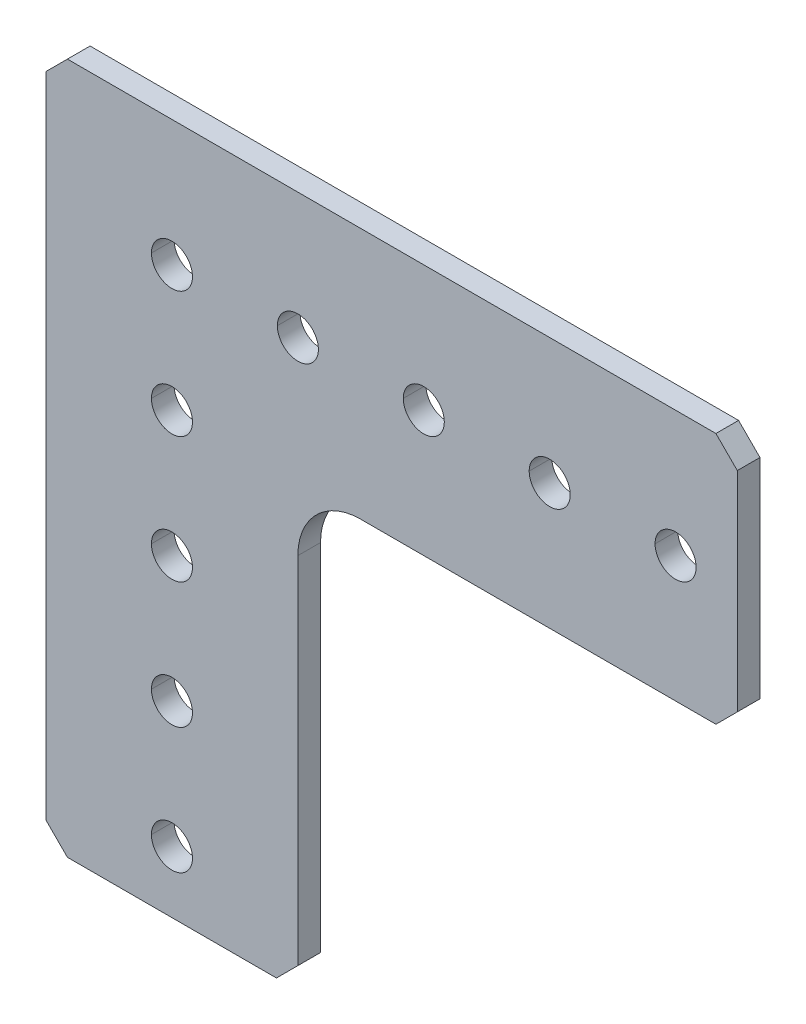
ISO-10303-21;
HEADER;
FILE_DESCRIPTION(('STEP AP214'),'2;1');
FILE_NAME('part.step','',(''),(''),'','','');
FILE_SCHEMA(('AUTOMOTIVE_DESIGN { 1 0 10303 214 1 1 1 1 }'));
ENDSEC;
DATA;
#1=APPLICATION_CONTEXT('core data for automotive mechanical design processes');
#2=APPLICATION_PROTOCOL_DEFINITION('international standard','automotive_design',2000,#1);
#3=PRODUCT_CONTEXT('',#1,'mechanical');
#4=PRODUCT('Part','Part','',(#3));
#5=PRODUCT_RELATED_PRODUCT_CATEGORY('part','',(#4));
#6=PRODUCT_DEFINITION_FORMATION('','',#4);
#7=PRODUCT_DEFINITION_CONTEXT('part definition',#1,'design');
#8=PRODUCT_DEFINITION('design','',#6,#7);
#9=PRODUCT_DEFINITION_SHAPE('','',#8);
#10=(LENGTH_UNIT() NAMED_UNIT(*) SI_UNIT(.MILLI.,.METRE.));
#11=(NAMED_UNIT(*) PLANE_ANGLE_UNIT() SI_UNIT($,.RADIAN.));
#12=(NAMED_UNIT(*) SI_UNIT($,.STERADIAN.) SOLID_ANGLE_UNIT());
#13=UNCERTAINTY_MEASURE_WITH_UNIT(LENGTH_MEASURE(1.E-05),#10,'distance_accuracy_value','');
#14=(GEOMETRIC_REPRESENTATION_CONTEXT(3) GLOBAL_UNCERTAINTY_ASSIGNED_CONTEXT((#13)) GLOBAL_UNIT_ASSIGNED_CONTEXT((#10,
#11,#12)) REPRESENTATION_CONTEXT('',''));
#15=CARTESIAN_POINT('',(0.,0.,0.));
#16=DIRECTION('',(0.,0.,1.));
#17=DIRECTION('',(1.,0.,0.));
#18=AXIS2_PLACEMENT_3D('',#15,#16,#17);
#19=CARTESIAN_POINT('',(12.7,-54.864,0.));
#20=DIRECTION('',(-0.707106781186548,0.707106781186547,0.));
#21=DIRECTION('',(0.,0.,1.));
#22=AXIS2_PLACEMENT_3D('',#19,#20,#21);
#23=PLANE('',#22);
#24=DIRECTION('',(0.707106781186547,0.707106781186548,0.));
#25=VECTOR('',#24,1.);
#26=CARTESIAN_POINT('',(12.7,-54.864,2.286));
#27=LINE('',#26,#25);
#28=CARTESIAN_POINT('',(10.541,-57.023,2.286));
#29=VERTEX_POINT('',#28);
#30=CARTESIAN_POINT('',(12.7,-54.864,2.286));
#31=VERTEX_POINT('',#30);
#32=EDGE_CURVE('E471',#29,#31,#27,.T.);
#33=ORIENTED_EDGE('',*,*,#32,.F.);
#34=DIRECTION('',(0.,0.,1.));
#35=VECTOR('',#34,1.);
#36=CARTESIAN_POINT('',(10.541,-57.023,2.286));
#37=LINE('',#36,#35);
#38=CARTESIAN_POINT('',(10.541,-57.023,0.));
#39=VERTEX_POINT('',#38);
#40=EDGE_CURVE('E373',#39,#29,#37,.T.);
#41=ORIENTED_EDGE('',*,*,#40,.F.);
#42=DIRECTION('',(-0.707106781186547,-0.707106781186548,0.));
#43=VECTOR('',#42,1.);
#44=CARTESIAN_POINT('',(33.782,-33.782,0.));
#45=LINE('',#44,#43);
#46=CARTESIAN_POINT('',(12.7,-54.864,0.));
#47=VERTEX_POINT('',#46);
#48=EDGE_CURVE('E430',#47,#39,#45,.T.);
#49=ORIENTED_EDGE('',*,*,#48,.F.);
#50=DIRECTION('',(0.,0.,-1.));
#51=VECTOR('',#50,1.);
#52=CARTESIAN_POINT('',(12.7,-54.864,0.));
#53=LINE('',#52,#51);
#54=EDGE_CURVE('E27',#31,#47,#53,.T.);
#55=ORIENTED_EDGE('',*,*,#54,.F.);
#56=EDGE_LOOP('',(#33,#41,#49,#55));
#57=FACE_BOUND('',#56,.T.);
#58=ADVANCED_FACE('F16',(#57),#23,.F.);
#59=CARTESIAN_POINT('',(-10.541,-57.023,2.286));
#60=DIRECTION('',(0.707106781186548,0.707106781186548,0.));
#61=DIRECTION('',(0.,0.,-1.));
#62=AXIS2_PLACEMENT_3D('',#59,#60,#61);
#63=PLANE('',#62);
#64=DIRECTION('',(0.707106781186548,-0.707106781186548,0.));
#65=VECTOR('',#64,1.);
#66=CARTESIAN_POINT('',(-10.541,-57.023,2.286));
#67=LINE('',#66,#65);
#68=CARTESIAN_POINT('',(-12.7,-54.864,2.286));
#69=VERTEX_POINT('',#68);
#70=CARTESIAN_POINT('',(-10.541,-57.023,2.286));
#71=VERTEX_POINT('',#70);
#72=EDGE_CURVE('E332',#69,#71,#67,.T.);
#73=ORIENTED_EDGE('',*,*,#72,.F.);
#74=DIRECTION('',(0.,0.,1.));
#75=VECTOR('',#74,1.);
#76=CARTESIAN_POINT('',(-12.7,-54.864,2.286));
#77=LINE('',#76,#75);
#78=CARTESIAN_POINT('',(-12.7,-54.864,0.));
#79=VERTEX_POINT('',#78);
#80=EDGE_CURVE('E354',#79,#69,#77,.T.);
#81=ORIENTED_EDGE('',*,*,#80,.F.);
#82=DIRECTION('',(-0.707106781186548,0.707106781186548,0.));
#83=VECTOR('',#82,1.);
#84=CARTESIAN_POINT('',(-46.482,-21.082,0.));
#85=LINE('',#84,#83);
#86=CARTESIAN_POINT('',(-10.541,-57.023,0.));
#87=VERTEX_POINT('',#86);
#88=EDGE_CURVE('E387',#87,#79,#85,.T.);
#89=ORIENTED_EDGE('',*,*,#88,.F.);
#90=DIRECTION('',(0.,0.,-1.));
#91=VECTOR('',#90,1.);
#92=CARTESIAN_POINT('',(-10.541,-57.023,2.286));
#93=LINE('',#92,#91);
#94=EDGE_CURVE('E377',#71,#87,#93,.T.);
#95=ORIENTED_EDGE('',*,*,#94,.F.);
#96=EDGE_LOOP('',(#73,#81,#89,#95));
#97=FACE_BOUND('',#96,.T.);
#98=ADVANCED_FACE('F697',(#97),#63,.F.);
#99=CARTESIAN_POINT('',(-12.7,10.541,2.286));
#100=DIRECTION('',(0.707106781186547,-0.707106781186548,0.));
#101=DIRECTION('',(0.,0.,-1.));
#102=AXIS2_PLACEMENT_3D('',#99,#100,#101);
#103=PLANE('',#102);
#104=DIRECTION('',(-0.707106781186548,-0.707106781186547,0.));
#105=VECTOR('',#104,1.);
#106=CARTESIAN_POINT('',(-12.7,10.541,2.286));
#107=LINE('',#106,#105);
#108=CARTESIAN_POINT('',(-10.541,12.7,2.286));
#109=VERTEX_POINT('',#108);
#110=CARTESIAN_POINT('',(-12.7,10.541,2.286));
#111=VERTEX_POINT('',#110);
#112=EDGE_CURVE('E482',#109,#111,#107,.T.);
#113=ORIENTED_EDGE('',*,*,#112,.F.);
#114=DIRECTION('',(0.,0.,1.));
#115=VECTOR('',#114,1.);
#116=CARTESIAN_POINT('',(-10.541,12.7,2.286));
#117=LINE('',#116,#115);
#118=CARTESIAN_POINT('',(-10.541,12.7,0.));
#119=VERTEX_POINT('',#118);
#120=EDGE_CURVE('E219',#119,#109,#117,.T.);
#121=ORIENTED_EDGE('',*,*,#120,.F.);
#122=DIRECTION('',(0.707106781186548,0.707106781186547,0.));
#123=VECTOR('',#122,1.);
#124=CARTESIAN_POINT('',(-11.6205,11.6205,0.));
#125=LINE('',#124,#123);
#126=CARTESIAN_POINT('',(-12.7,10.541,0.));
#127=VERTEX_POINT('',#126);
#128=EDGE_CURVE('E386',#127,#119,#125,.T.);
#129=ORIENTED_EDGE('',*,*,#128,.F.);
#130=DIRECTION('',(0.,0.,-1.));
#131=VECTOR('',#130,1.);
#132=CARTESIAN_POINT('',(-12.7,10.541,2.286));
#133=LINE('',#132,#131);
#134=EDGE_CURVE('E230',#111,#127,#133,.T.);
#135=ORIENTED_EDGE('',*,*,#134,.F.);
#136=EDGE_LOOP('',(#113,#121,#129,#135));
#137=FACE_BOUND('',#136,.T.);
#138=ADVANCED_FACE('F699',(#137),#103,.F.);
#139=CARTESIAN_POINT('',(54.864,12.7,2.286));
#140=DIRECTION('',(-0.707106781186546,-0.707106781186549,0.));
#141=DIRECTION('',(-0.707106781186549,0.707106781186546,0.));
#142=AXIS2_PLACEMENT_3D('',#139,#140,#141);
#143=PLANE('',#142);
#144=DIRECTION('',(-0.707106781186549,0.707106781186546,0.));
#145=VECTOR('',#144,1.);
#146=CARTESIAN_POINT('',(54.864,12.7,2.286));
#147=LINE('',#146,#145);
#148=CARTESIAN_POINT('',(57.023,10.541,2.286));
#149=VERTEX_POINT('',#148);
#150=CARTESIAN_POINT('',(54.864,12.7,2.286));
#151=VERTEX_POINT('',#150);
#152=EDGE_CURVE('E364',#149,#151,#147,.T.);
#153=ORIENTED_EDGE('',*,*,#152,.F.);
#154=DIRECTION('',(0.,0.,1.));
#155=VECTOR('',#154,1.);
#156=CARTESIAN_POINT('',(57.023,10.541,2.286));
#157=LINE('',#156,#155);
#158=CARTESIAN_POINT('',(57.023,10.541,0.));
#159=VERTEX_POINT('',#158);
#160=EDGE_CURVE('E501',#159,#149,#157,.T.);
#161=ORIENTED_EDGE('',*,*,#160,.F.);
#162=DIRECTION('',(0.707106781186549,-0.707106781186546,0.));
#163=VECTOR('',#162,1.);
#164=CARTESIAN_POINT('',(21.082,46.482,0.));
#165=LINE('',#164,#163);
#166=CARTESIAN_POINT('',(54.864,12.7,0.));
#167=VERTEX_POINT('',#166);
#168=EDGE_CURVE('E456',#167,#159,#165,.T.);
#169=ORIENTED_EDGE('',*,*,#168,.F.);
#170=DIRECTION('',(0.,0.,-1.));
#171=VECTOR('',#170,1.);
#172=CARTESIAN_POINT('',(54.864,12.7,2.286));
#173=LINE('',#172,#171);
#174=EDGE_CURVE('E477',#151,#167,#173,.T.);
#175=ORIENTED_EDGE('',*,*,#174,.F.);
#176=EDGE_LOOP('',(#153,#161,#169,#175));
#177=FACE_BOUND('',#176,.T.);
#178=ADVANCED_FACE('F705',(#177),#143,.F.);
#179=CARTESIAN_POINT('',(57.023,-10.541,2.286));
#180=DIRECTION('',(0.707106781186548,-0.707106781186548,0.));
#181=DIRECTION('',(0.,0.,-1.));
#182=AXIS2_PLACEMENT_3D('',#179,#180,#181);
#183=PLANE('',#182);
#184=DIRECTION('',(0.707106781186548,0.707106781186548,0.));
#185=VECTOR('',#184,1.);
#186=CARTESIAN_POINT('',(57.023,-10.541,2.286));
#187=LINE('',#186,#185);
#188=CARTESIAN_POINT('',(54.864,-12.7,2.286));
#189=VERTEX_POINT('',#188);
#190=CARTESIAN_POINT('',(57.023,-10.541,2.286));
#191=VERTEX_POINT('',#190);
#192=EDGE_CURVE('E381',#189,#191,#187,.T.);
#193=ORIENTED_EDGE('',*,*,#192,.F.);
#194=DIRECTION('',(0.,0.,1.));
#195=VECTOR('',#194,1.);
#196=CARTESIAN_POINT('',(54.864,-12.7,2.286));
#197=LINE('',#196,#195);
#198=CARTESIAN_POINT('',(54.864,-12.7,0.));
#199=VERTEX_POINT('',#198);
#200=EDGE_CURVE('E481',#199,#189,#197,.T.);
#201=ORIENTED_EDGE('',*,*,#200,.F.);
#202=DIRECTION('',(-0.707106781186548,-0.707106781186548,0.));
#203=VECTOR('',#202,1.);
#204=CARTESIAN_POINT('',(33.782,-33.782,0.));
#205=LINE('',#204,#203);
#206=CARTESIAN_POINT('',(57.023,-10.541,0.));
#207=VERTEX_POINT('',#206);
#208=EDGE_CURVE('E438',#207,#199,#205,.T.);
#209=ORIENTED_EDGE('',*,*,#208,.F.);
#210=DIRECTION('',(0.,0.,-1.));
#211=VECTOR('',#210,1.);
#212=CARTESIAN_POINT('',(57.023,-10.541,0.));
#213=LINE('',#212,#211);
#214=EDGE_CURVE('E618',#191,#207,#213,.T.);
#215=ORIENTED_EDGE('',*,*,#214,.F.);
#216=EDGE_LOOP('',(#193,#201,#209,#215));
#217=FACE_BOUND('',#216,.T.);
#218=ADVANCED_FACE('F711',(#217),#183,.T.);
#219=CARTESIAN_POINT('',(19.05,-19.05,0.));
#220=DIRECTION('',(0.,0.,1.));
#221=DIRECTION('',(1.,0.,0.));
#222=AXIS2_PLACEMENT_3D('',#219,#220,#221);
#223=CYLINDRICAL_SURFACE('',#222,6.35);
#224=CARTESIAN_POINT('',(19.05,-19.05,2.286));
#225=DIRECTION('',(0.,0.,1.));
#226=DIRECTION('',(1.,0.,0.));
#227=AXIS2_PLACEMENT_3D('',#224,#225,#226);
#228=CIRCLE('',#227,6.35);
#229=CARTESIAN_POINT('',(19.05,-12.7,2.286));
#230=VERTEX_POINT('',#229);
#231=CARTESIAN_POINT('',(12.7,-19.05,2.286));
#232=VERTEX_POINT('',#231);
#233=EDGE_CURVE('E470',#230,#232,#228,.T.);
#234=ORIENTED_EDGE('',*,*,#233,.T.);
#235=DIRECTION('',(0.,0.,1.));
#236=VECTOR('',#235,1.);
#237=CARTESIAN_POINT('',(12.7,-19.05,0.));
#238=LINE('',#237,#236);
#239=CARTESIAN_POINT('',(12.7,-19.05,0.));
#240=VERTEX_POINT('',#239);
#241=EDGE_CURVE('E11',#240,#232,#238,.T.);
#242=ORIENTED_EDGE('',*,*,#241,.F.);
#243=CARTESIAN_POINT('',(19.05,-19.05,0.));
#244=DIRECTION('',(0.,0.,1.));
#245=DIRECTION('',(1.,0.,0.));
#246=AXIS2_PLACEMENT_3D('',#243,#244,#245);
#247=CIRCLE('',#246,6.35);
#248=CARTESIAN_POINT('',(19.05,-12.7,0.));
#249=VERTEX_POINT('',#248);
#250=EDGE_CURVE('E437',#249,#240,#247,.T.);
#251=ORIENTED_EDGE('',*,*,#250,.F.);
#252=DIRECTION('',(0.,0.,1.));
#253=VECTOR('',#252,1.);
#254=CARTESIAN_POINT('',(19.05,-12.7,0.));
#255=LINE('',#254,#253);
#256=EDGE_CURVE('E42',#249,#230,#255,.T.);
#257=ORIENTED_EDGE('',*,*,#256,.T.);
#258=EDGE_LOOP('',(#234,#242,#251,#257));
#259=FACE_BOUND('',#258,.T.);
#260=ADVANCED_FACE('F685',(#259),#223,.F.);
#261=CARTESIAN_POINT('',(12.7,0.,0.));
#262=DIRECTION('',(-1.,0.,0.));
#263=DIRECTION('',(0.,0.,1.));
#264=AXIS2_PLACEMENT_3D('',#261,#262,#263);
#265=PLANE('',#264);
#266=DIRECTION('',(0.,-1.,0.));
#267=VECTOR('',#266,1.);
#268=CARTESIAN_POINT('',(12.7,0.,2.286));
#269=LINE('',#268,#267);
#270=EDGE_CURVE('E467',#232,#31,#269,.T.);
#271=ORIENTED_EDGE('',*,*,#270,.T.);
#272=ORIENTED_EDGE('',*,*,#54,.T.);
#273=DIRECTION('',(0.,-1.,0.));
#274=VECTOR('',#273,1.);
#275=CARTESIAN_POINT('',(12.7,0.,0.));
#276=LINE('',#275,#274);
#277=EDGE_CURVE('E406',#240,#47,#276,.T.);
#278=ORIENTED_EDGE('',*,*,#277,.F.);
#279=ORIENTED_EDGE('',*,*,#241,.T.);
#280=EDGE_LOOP('',(#271,#272,#278,#279));
#281=FACE_BOUND('',#280,.T.);
#282=ADVANCED_FACE('F682',(#281),#265,.F.);
#283=CARTESIAN_POINT('',(0.,-12.7,0.));
#284=DIRECTION('',(0.,-1.,0.));
#285=DIRECTION('',(0.,0.,-1.));
#286=AXIS2_PLACEMENT_3D('',#283,#284,#285);
#287=PLANE('',#286);
#288=DIRECTION('',(1.,0.,0.));
#289=VECTOR('',#288,1.);
#290=CARTESIAN_POINT('',(0.,-12.7,0.));
#291=LINE('',#290,#289);
#292=EDGE_CURVE('E435',#249,#199,#291,.T.);
#293=ORIENTED_EDGE('',*,*,#292,.T.);
#294=ORIENTED_EDGE('',*,*,#200,.T.);
#295=DIRECTION('',(1.,0.,0.));
#296=VECTOR('',#295,1.);
#297=CARTESIAN_POINT('',(0.,-12.7,2.286));
#298=LINE('',#297,#296);
#299=EDGE_CURVE('E544',#230,#189,#298,.T.);
#300=ORIENTED_EDGE('',*,*,#299,.F.);
#301=ORIENTED_EDGE('',*,*,#256,.F.);
#302=EDGE_LOOP('',(#293,#294,#300,#301));
#303=FACE_BOUND('',#302,.T.);
#304=ADVANCED_FACE('F712',(#303),#287,.T.);
#305=CARTESIAN_POINT('',(50.8,0.,2.286));
#306=DIRECTION('',(0.,0.,-1.));
#307=DIRECTION('',(-1.,0.,0.));
#308=AXIS2_PLACEMENT_3D('',#305,#306,#307);
#309=CYLINDRICAL_SURFACE('',#308,2.0701);
#310=DIRECTION('',(0.,0.,-1.));
#311=VECTOR('',#310,1.);
#312=CARTESIAN_POINT('',(52.8701,0.,2.286));
#313=LINE('',#312,#311);
#314=CARTESIAN_POINT('',(52.8701,0.,2.286));
#315=VERTEX_POINT('',#314);
#316=CARTESIAN_POINT('',(52.8701,0.,0.));
#317=VERTEX_POINT('',#316);
#318=EDGE_CURVE('E326',#315,#317,#313,.T.);
#319=ORIENTED_EDGE('',*,*,#318,.F.);
#320=CARTESIAN_POINT('',(50.8,0.,2.286));
#321=DIRECTION('',(0.,0.,1.));
#322=DIRECTION('',(1.,0.,0.));
#323=AXIS2_PLACEMENT_3D('',#320,#321,#322);
#324=CIRCLE('',#323,2.0701);
#325=CARTESIAN_POINT('',(48.7299,0.,2.286));
#326=VERTEX_POINT('',#325);
#327=EDGE_CURVE('E320',#315,#326,#324,.T.);
#328=ORIENTED_EDGE('',*,*,#327,.T.);
#329=DIRECTION('',(0.,0.,-1.));
#330=VECTOR('',#329,1.);
#331=CARTESIAN_POINT('',(48.7299,0.,2.286));
#332=LINE('',#331,#330);
#333=CARTESIAN_POINT('',(48.7299,0.,0.));
#334=VERTEX_POINT('',#333);
#335=EDGE_CURVE('E323',#326,#334,#332,.T.);
#336=ORIENTED_EDGE('',*,*,#335,.T.);
#337=CARTESIAN_POINT('',(50.8,0.,0.));
#338=DIRECTION('',(0.,0.,1.));
#339=DIRECTION('',(1.,0.,0.));
#340=AXIS2_PLACEMENT_3D('',#337,#338,#339);
#341=CIRCLE('',#340,2.0701);
#342=EDGE_CURVE('E357',#317,#334,#341,.T.);
#343=ORIENTED_EDGE('',*,*,#342,.F.);
#344=EDGE_LOOP('',(#319,#328,#336,#343));
#345=FACE_BOUND('',#344,.T.);
#346=ADVANCED_FACE('F322',(#345),#309,.F.);
#347=CARTESIAN_POINT('',(0.,-50.8,2.286));
#348=DIRECTION('',(0.,0.,-1.));
#349=DIRECTION('',(-1.,0.,0.));
#350=AXIS2_PLACEMENT_3D('',#347,#348,#349);
#351=CYLINDRICAL_SURFACE('',#350,2.0701);
#352=DIRECTION('',(0.,0.,-1.));
#353=VECTOR('',#352,1.);
#354=CARTESIAN_POINT('',(2.0701,-50.8,2.286));
#355=LINE('',#354,#353);
#356=CARTESIAN_POINT('',(2.0701,-50.8,2.286));
#357=VERTEX_POINT('',#356);
#358=CARTESIAN_POINT('',(2.0701,-50.8,0.));
#359=VERTEX_POINT('',#358);
#360=EDGE_CURVE('E363',#357,#359,#355,.T.);
#361=ORIENTED_EDGE('',*,*,#360,.F.);
#362=CARTESIAN_POINT('',(0.,-50.8,2.286));
#363=DIRECTION('',(0.,0.,1.));
#364=DIRECTION('',(1.,0.,0.));
#365=AXIS2_PLACEMENT_3D('',#362,#363,#364);
#366=CIRCLE('',#365,2.0701);
#367=CARTESIAN_POINT('',(-2.0701,-50.8,2.286));
#368=VERTEX_POINT('',#367);
#369=EDGE_CURVE('E331',#357,#368,#366,.T.);
#370=ORIENTED_EDGE('',*,*,#369,.T.);
#371=DIRECTION('',(0.,0.,-1.));
#372=VECTOR('',#371,1.);
#373=CARTESIAN_POINT('',(-2.0701,-50.8,2.286));
#374=LINE('',#373,#372);
#375=CARTESIAN_POINT('',(-2.0701,-50.8,0.));
#376=VERTEX_POINT('',#375);
#377=EDGE_CURVE('E362',#368,#376,#374,.T.);
#378=ORIENTED_EDGE('',*,*,#377,.T.);
#379=CARTESIAN_POINT('',(0.,-50.8,0.));
#380=DIRECTION('',(0.,0.,1.));
#381=DIRECTION('',(1.,0.,0.));
#382=AXIS2_PLACEMENT_3D('',#379,#380,#381);
#383=CIRCLE('',#382,2.0701);
#384=EDGE_CURVE('E445',#359,#376,#383,.T.);
#385=ORIENTED_EDGE('',*,*,#384,.F.);
#386=EDGE_LOOP('',(#361,#370,#378,#385));
#387=FACE_BOUND('',#386,.T.);
#388=ADVANCED_FACE('F720',(#387),#351,.F.);
#389=CARTESIAN_POINT('',(3.9907631702977E-13,-38.1,2.286));
#390=DIRECTION('',(0.,0.,-1.));
#391=DIRECTION('',(-1.,0.,0.));
#392=AXIS2_PLACEMENT_3D('',#389,#390,#391);
#393=CYLINDRICAL_SURFACE('',#392,2.0701);
#394=DIRECTION('',(0.,0.,-1.));
#395=VECTOR('',#394,1.);
#396=CARTESIAN_POINT('',(2.0701000000004,-38.1,2.286));
#397=LINE('',#396,#395);
#398=CARTESIAN_POINT('',(2.0701000000004,-38.1,2.286));
#399=VERTEX_POINT('',#398);
#400=CARTESIAN_POINT('',(2.0701000000004,-38.1,0.));
#401=VERTEX_POINT('',#400);
#402=EDGE_CURVE('E423',#399,#401,#397,.T.);
#403=ORIENTED_EDGE('',*,*,#402,.F.);
#404=CARTESIAN_POINT('',(3.9907631702977E-13,-38.1,2.286));
#405=DIRECTION('',(0.,0.,1.));
#406=DIRECTION('',(1.,0.,0.));
#407=AXIS2_PLACEMENT_3D('',#404,#405,#406);
#408=CIRCLE('',#407,2.0701);
#409=CARTESIAN_POINT('',(-2.0700999999996,-38.1,2.286));
#410=VERTEX_POINT('',#409);
#411=EDGE_CURVE('E395',#399,#410,#408,.T.);
#412=ORIENTED_EDGE('',*,*,#411,.T.);
#413=DIRECTION('',(0.,0.,-1.));
#414=VECTOR('',#413,1.);
#415=CARTESIAN_POINT('',(-2.0700999999996,-38.1,2.286));
#416=LINE('',#415,#414);
#417=CARTESIAN_POINT('',(-2.0700999999996,-38.1,0.));
#418=VERTEX_POINT('',#417);
#419=EDGE_CURVE('E595',#410,#418,#416,.T.);
#420=ORIENTED_EDGE('',*,*,#419,.T.);
#421=CARTESIAN_POINT('',(3.9907631702977E-13,-38.1,0.));
#422=DIRECTION('',(0.,0.,1.));
#423=DIRECTION('',(1.,0.,0.));
#424=AXIS2_PLACEMENT_3D('',#421,#422,#423);
#425=CIRCLE('',#424,2.0701);
#426=EDGE_CURVE('E411',#401,#418,#425,.T.);
#427=ORIENTED_EDGE('',*,*,#426,.F.);
#428=EDGE_LOOP('',(#403,#412,#420,#427));
#429=FACE_BOUND('',#428,.T.);
#430=ADVANCED_FACE('F1189',(#429),#393,.F.);
#431=CARTESIAN_POINT('',(2.66050878019847E-13,-25.4,2.286));
#432=DIRECTION('',(0.,0.,-1.));
#433=DIRECTION('',(-1.,0.,0.));
#434=AXIS2_PLACEMENT_3D('',#431,#432,#433);
#435=CYLINDRICAL_SURFACE('',#434,2.0701);
#436=DIRECTION('',(0.,0.,-1.));
#437=VECTOR('',#436,1.);
#438=CARTESIAN_POINT('',(2.07010000000027,-25.4,2.286));
#439=LINE('',#438,#437);
#440=CARTESIAN_POINT('',(2.07010000000027,-25.4,2.286));
#441=VERTEX_POINT('',#440);
#442=CARTESIAN_POINT('',(2.07010000000027,-25.4,0.));
#443=VERTEX_POINT('',#442);
#444=EDGE_CURVE('E609',#441,#443,#439,.T.);
#445=ORIENTED_EDGE('',*,*,#444,.F.);
#446=CARTESIAN_POINT('',(2.66050878019847E-13,-25.4,2.286));
#447=DIRECTION('',(0.,0.,1.));
#448=DIRECTION('',(1.,0.,0.));
#449=AXIS2_PLACEMENT_3D('',#446,#447,#448);
#450=CIRCLE('',#449,2.0701);
#451=CARTESIAN_POINT('',(-2.07009999999973,-25.4,2.286));
#452=VERTEX_POINT('',#451);
#453=EDGE_CURVE('E504',#441,#452,#450,.T.);
#454=ORIENTED_EDGE('',*,*,#453,.T.);
#455=DIRECTION('',(0.,0.,-1.));
#456=VECTOR('',#455,1.);
#457=CARTESIAN_POINT('',(-2.07009999999973,-25.4,2.286));
#458=LINE('',#457,#456);
#459=CARTESIAN_POINT('',(-2.07009999999973,-25.4,0.));
#460=VERTEX_POINT('',#459);
#461=EDGE_CURVE('E512',#452,#460,#458,.T.);
#462=ORIENTED_EDGE('',*,*,#461,.T.);
#463=CARTESIAN_POINT('',(2.66050878019847E-13,-25.4,0.));
#464=DIRECTION('',(0.,0.,1.));
#465=DIRECTION('',(1.,0.,0.));
#466=AXIS2_PLACEMENT_3D('',#463,#464,#465);
#467=CIRCLE('',#466,2.0701);
#468=EDGE_CURVE('E567',#443,#460,#467,.T.);
#469=ORIENTED_EDGE('',*,*,#468,.F.);
#470=EDGE_LOOP('',(#445,#454,#462,#469));
#471=FACE_BOUND('',#470,.T.);
#472=ADVANCED_FACE('F1193',(#471),#435,.F.);
#473=CARTESIAN_POINT('',(1.33025439009923E-13,-12.7,2.286));
#474=DIRECTION('',(0.,0.,-1.));
#475=DIRECTION('',(-1.,0.,0.));
#476=AXIS2_PLACEMENT_3D('',#473,#474,#475);
#477=CYLINDRICAL_SURFACE('',#476,2.0701);
#478=DIRECTION('',(0.,0.,-1.));
#479=VECTOR('',#478,1.);
#480=CARTESIAN_POINT('',(2.07010000000014,-12.7,2.286));
#481=LINE('',#480,#479);
#482=CARTESIAN_POINT('',(2.07010000000014,-12.7,2.286));
#483=VERTEX_POINT('',#482);
#484=CARTESIAN_POINT('',(2.07010000000014,-12.7,0.));
#485=VERTEX_POINT('',#484);
#486=EDGE_CURVE('E511',#483,#485,#481,.T.);
#487=ORIENTED_EDGE('',*,*,#486,.F.);
#488=CARTESIAN_POINT('',(1.33025439009923E-13,-12.7,2.286));
#489=DIRECTION('',(0.,0.,1.));
#490=DIRECTION('',(1.,0.,0.));
#491=AXIS2_PLACEMENT_3D('',#488,#489,#490);
#492=CIRCLE('',#491,2.0701);
#493=CARTESIAN_POINT('',(-2.07009999999987,-12.7,2.286));
#494=VERTEX_POINT('',#493);
#495=EDGE_CURVE('E547',#483,#494,#492,.T.);
#496=ORIENTED_EDGE('',*,*,#495,.T.);
#497=DIRECTION('',(0.,0.,-1.));
#498=VECTOR('',#497,1.);
#499=CARTESIAN_POINT('',(-2.07009999999987,-12.7,2.286));
#500=LINE('',#499,#498);
#501=CARTESIAN_POINT('',(-2.07009999999987,-12.7,0.));
#502=VERTEX_POINT('',#501);
#503=EDGE_CURVE('E534',#494,#502,#500,.T.);
#504=ORIENTED_EDGE('',*,*,#503,.T.);
#505=CARTESIAN_POINT('',(1.33025439009923E-13,-12.7,0.));
#506=DIRECTION('',(0.,0.,1.));
#507=DIRECTION('',(1.,0.,0.));
#508=AXIS2_PLACEMENT_3D('',#505,#506,#507);
#509=CIRCLE('',#508,2.0701);
#510=EDGE_CURVE('E408',#485,#502,#509,.T.);
#511=ORIENTED_EDGE('',*,*,#510,.F.);
#512=EDGE_LOOP('',(#487,#496,#504,#511));
#513=FACE_BOUND('',#512,.T.);
#514=ADVANCED_FACE('F1182',(#513),#477,.F.);
#515=CARTESIAN_POINT('',(38.1,0.,2.286));
#516=DIRECTION('',(0.,0.,-1.));
#517=DIRECTION('',(-1.,0.,0.));
#518=AXIS2_PLACEMENT_3D('',#515,#516,#517);
#519=CYLINDRICAL_SURFACE('',#518,2.0701);
#520=DIRECTION('',(0.,0.,-1.));
#521=VECTOR('',#520,1.);
#522=CARTESIAN_POINT('',(40.1701,0.,2.286));
#523=LINE('',#522,#521);
#524=CARTESIAN_POINT('',(40.1701,0.,2.286));
#525=VERTEX_POINT('',#524);
#526=CARTESIAN_POINT('',(40.1701,0.,0.));
#527=VERTEX_POINT('',#526);
#528=EDGE_CURVE('E392',#525,#527,#523,.T.);
#529=ORIENTED_EDGE('',*,*,#528,.F.);
#530=CARTESIAN_POINT('',(38.1,0.,2.286));
#531=DIRECTION('',(0.,0.,1.));
#532=DIRECTION('',(1.,0.,0.));
#533=AXIS2_PLACEMENT_3D('',#530,#531,#532);
#534=CIRCLE('',#533,2.0701);
#535=CARTESIAN_POINT('',(36.0299,0.,2.286));
#536=VERTEX_POINT('',#535);
#537=EDGE_CURVE('E517',#525,#536,#534,.T.);
#538=ORIENTED_EDGE('',*,*,#537,.T.);
#539=DIRECTION('',(0.,0.,-1.));
#540=VECTOR('',#539,1.);
#541=CARTESIAN_POINT('',(36.0299,0.,2.286));
#542=LINE('',#541,#540);
#543=CARTESIAN_POINT('',(36.0299,0.,0.));
#544=VERTEX_POINT('',#543);
#545=EDGE_CURVE('E391',#536,#544,#542,.T.);
#546=ORIENTED_EDGE('',*,*,#545,.T.);
#547=CARTESIAN_POINT('',(38.1,0.,0.));
#548=DIRECTION('',(0.,0.,1.));
#549=DIRECTION('',(1.,0.,0.));
#550=AXIS2_PLACEMENT_3D('',#547,#548,#549);
#551=CIRCLE('',#550,2.0701);
#552=EDGE_CURVE('E284',#527,#544,#551,.T.);
#553=ORIENTED_EDGE('',*,*,#552,.F.);
#554=EDGE_LOOP('',(#529,#538,#546,#553));
#555=FACE_BOUND('',#554,.T.);
#556=ADVANCED_FACE('F671',(#555),#519,.F.);
#557=CARTESIAN_POINT('',(25.4,3.54734504026463E-13,2.286));
#558=DIRECTION('',(0.,0.,-1.));
#559=DIRECTION('',(-1.,0.,0.));
#560=AXIS2_PLACEMENT_3D('',#557,#558,#559);
#561=CYLINDRICAL_SURFACE('',#560,2.0701);
#562=DIRECTION('',(0.,0.,-1.));
#563=VECTOR('',#562,1.);
#564=CARTESIAN_POINT('',(27.4701,3.54988018160354E-13,2.286));
#565=LINE('',#564,#563);
#566=CARTESIAN_POINT('',(27.4701,3.54988018160354E-13,2.286));
#567=VERTEX_POINT('',#566);
#568=CARTESIAN_POINT('',(27.4701,3.54988018160354E-13,0.));
#569=VERTEX_POINT('',#568);
#570=EDGE_CURVE('E558',#567,#569,#565,.T.);
#571=ORIENTED_EDGE('',*,*,#570,.F.);
#572=CARTESIAN_POINT('',(25.4,3.54734504026463E-13,2.286));
#573=DIRECTION('',(0.,0.,1.));
#574=DIRECTION('',(1.,0.,0.));
#575=AXIS2_PLACEMENT_3D('',#572,#573,#574);
#576=CIRCLE('',#575,2.0701);
#577=CARTESIAN_POINT('',(23.3299,3.54734504026463E-13,2.286));
#578=VERTEX_POINT('',#577);
#579=EDGE_CURVE('E426',#567,#578,#576,.T.);
#580=ORIENTED_EDGE('',*,*,#579,.T.);
#581=DIRECTION('',(0.,0.,-1.));
#582=VECTOR('',#581,1.);
#583=CARTESIAN_POINT('',(23.3299,3.54734504026463E-13,2.286));
#584=LINE('',#583,#582);
#585=CARTESIAN_POINT('',(23.3299,3.54734504026463E-13,0.));
#586=VERTEX_POINT('',#585);
#587=EDGE_CURVE('E476',#578,#586,#584,.T.);
#588=ORIENTED_EDGE('',*,*,#587,.T.);
#589=CARTESIAN_POINT('',(25.4,3.54734504026463E-13,0.));
#590=DIRECTION('',(0.,0.,1.));
#591=DIRECTION('',(1.,0.,0.));
#592=AXIS2_PLACEMENT_3D('',#589,#590,#591);
#593=CIRCLE('',#592,2.0701);
#594=EDGE_CURVE('E412',#569,#586,#593,.T.);
#595=ORIENTED_EDGE('',*,*,#594,.F.);
#596=EDGE_LOOP('',(#571,#580,#588,#595));
#597=FACE_BOUND('',#596,.T.);
#598=ADVANCED_FACE('F1181',(#597),#561,.F.);
#599=CARTESIAN_POINT('',(12.7,1.77367252013231E-13,2.286));
#600=DIRECTION('',(0.,0.,-1.));
#601=DIRECTION('',(-1.,0.,0.));
#602=AXIS2_PLACEMENT_3D('',#599,#600,#601);
#603=CYLINDRICAL_SURFACE('',#602,2.0701);
#604=DIRECTION('',(0.,0.,-1.));
#605=VECTOR('',#604,1.);
#606=CARTESIAN_POINT('',(14.7701,1.77620766147122E-13,2.286));
#607=LINE('',#606,#605);
#608=CARTESIAN_POINT('',(14.7701,1.77620766147122E-13,2.286));
#609=VERTEX_POINT('',#608);
#610=CARTESIAN_POINT('',(14.7701,1.77620766147122E-13,0.));
#611=VERTEX_POINT('',#610);
#612=EDGE_CURVE('E352',#609,#611,#607,.T.);
#613=ORIENTED_EDGE('',*,*,#612,.F.);
#614=CARTESIAN_POINT('',(12.7,1.77367252013231E-13,2.286));
#615=DIRECTION('',(0.,0.,1.));
#616=DIRECTION('',(1.,0.,0.));
#617=AXIS2_PLACEMENT_3D('',#614,#615,#616);
#618=CIRCLE('',#617,2.0701);
#619=CARTESIAN_POINT('',(10.6299,1.77367252013231E-13,2.286));
#620=VERTEX_POINT('',#619);
#621=EDGE_CURVE('E407',#609,#620,#618,.T.);
#622=ORIENTED_EDGE('',*,*,#621,.T.);
#623=DIRECTION('',(0.,0.,-1.));
#624=VECTOR('',#623,1.);
#625=CARTESIAN_POINT('',(10.6299,1.77367252013231E-13,2.286));
#626=LINE('',#625,#624);
#627=CARTESIAN_POINT('',(10.6299,1.77367252013231E-13,0.));
#628=VERTEX_POINT('',#627);
#629=EDGE_CURVE('E434',#620,#628,#626,.T.);
#630=ORIENTED_EDGE('',*,*,#629,.T.);
#631=CARTESIAN_POINT('',(12.7,1.77367252013231E-13,0.));
#632=DIRECTION('',(0.,0.,1.));
#633=DIRECTION('',(1.,0.,0.));
#634=AXIS2_PLACEMENT_3D('',#631,#632,#633);
#635=CIRCLE('',#634,2.0701);
#636=EDGE_CURVE('E270',#611,#628,#635,.T.);
#637=ORIENTED_EDGE('',*,*,#636,.F.);
#638=EDGE_LOOP('',(#613,#622,#630,#637));
#639=FACE_BOUND('',#638,.T.);
#640=ADVANCED_FACE('F732',(#639),#603,.F.);
#641=CARTESIAN_POINT('',(0.,0.,2.286));
#642=DIRECTION('',(0.,0.,-1.));
#643=DIRECTION('',(-1.,0.,0.));
#644=AXIS2_PLACEMENT_3D('',#641,#642,#643);
#645=CYLINDRICAL_SURFACE('',#644,2.0701);
#646=DIRECTION('',(0.,0.,-1.));
#647=VECTOR('',#646,1.);
#648=CARTESIAN_POINT('',(2.0701,0.,2.286));
#649=LINE('',#648,#647);
#650=CARTESIAN_POINT('',(2.0701,0.,2.286));
#651=VERTEX_POINT('',#650);
#652=CARTESIAN_POINT('',(2.0701,0.,0.));
#653=VERTEX_POINT('',#652);
#654=EDGE_CURVE('E519',#651,#653,#649,.T.);
#655=ORIENTED_EDGE('',*,*,#654,.F.);
#656=CARTESIAN_POINT('',(0.,0.,2.286));
#657=DIRECTION('',(0.,0.,1.));
#658=DIRECTION('',(1.,0.,0.));
#659=AXIS2_PLACEMENT_3D('',#656,#657,#658);
#660=CIRCLE('',#659,2.0701);
#661=CARTESIAN_POINT('',(-2.0701,0.,2.286));
#662=VERTEX_POINT('',#661);
#663=EDGE_CURVE('E257',#651,#662,#660,.T.);
#664=ORIENTED_EDGE('',*,*,#663,.T.);
#665=DIRECTION('',(0.,0.,-1.));
#666=VECTOR('',#665,1.);
#667=CARTESIAN_POINT('',(-2.0701,0.,2.286));
#668=LINE('',#667,#666);
#669=CARTESIAN_POINT('',(-2.0701,0.,0.));
#670=VERTEX_POINT('',#669);
#671=EDGE_CURVE('E462',#662,#670,#668,.T.);
#672=ORIENTED_EDGE('',*,*,#671,.T.);
#673=CARTESIAN_POINT('',(0.,0.,0.));
#674=DIRECTION('',(0.,0.,1.));
#675=DIRECTION('',(1.,0.,0.));
#676=AXIS2_PLACEMENT_3D('',#673,#674,#675);
#677=CIRCLE('',#676,2.0701);
#678=EDGE_CURVE('E372',#653,#670,#677,.T.);
#679=ORIENTED_EDGE('',*,*,#678,.F.);
#680=EDGE_LOOP('',(#655,#664,#672,#679));
#681=FACE_BOUND('',#680,.T.);
#682=ADVANCED_FACE('F1295',(#681),#645,.F.);
#683=CARTESIAN_POINT('',(-12.7,12.7,2.286));
#684=DIRECTION('',(0.,-1.,0.));
#685=DIRECTION('',(0.,0.,-1.));
#686=AXIS2_PLACEMENT_3D('',#683,#684,#685);
#687=PLANE('',#686);
#688=DIRECTION('',(-1.,0.,0.));
#689=VECTOR('',#688,1.);
#690=CARTESIAN_POINT('',(-12.7,12.7,0.));
#691=LINE('',#690,#689);
#692=EDGE_CURVE('E570',#167,#119,#691,.T.);
#693=ORIENTED_EDGE('',*,*,#692,.T.);
#694=ORIENTED_EDGE('',*,*,#120,.T.);
#695=DIRECTION('',(-1.,0.,0.));
#696=VECTOR('',#695,1.);
#697=CARTESIAN_POINT('',(-12.7,12.7,2.286));
#698=LINE('',#697,#696);
#699=EDGE_CURVE('E368',#151,#109,#698,.T.);
#700=ORIENTED_EDGE('',*,*,#699,.F.);
#701=ORIENTED_EDGE('',*,*,#174,.T.);
#702=EDGE_LOOP('',(#693,#694,#700,#701));
#703=FACE_BOUND('',#702,.T.);
#704=ADVANCED_FACE('F702',(#703),#687,.F.);
#705=CARTESIAN_POINT('',(57.023,12.7,2.286));
#706=DIRECTION('',(-1.,0.,0.));
#707=DIRECTION('',(0.,1.,0.));
#708=AXIS2_PLACEMENT_3D('',#705,#706,#707);
#709=PLANE('',#708);
#710=DIRECTION('',(0.,1.,0.));
#711=VECTOR('',#710,1.);
#712=CARTESIAN_POINT('',(57.023,12.7,0.));
#713=LINE('',#712,#711);
#714=EDGE_CURVE('E447',#207,#159,#713,.T.);
#715=ORIENTED_EDGE('',*,*,#714,.T.);
#716=ORIENTED_EDGE('',*,*,#160,.T.);
#717=DIRECTION('',(0.,1.,0.));
#718=VECTOR('',#717,1.);
#719=CARTESIAN_POINT('',(57.023,12.7,2.286));
#720=LINE('',#719,#718);
#721=EDGE_CURVE('E369',#191,#149,#720,.T.);
#722=ORIENTED_EDGE('',*,*,#721,.F.);
#723=ORIENTED_EDGE('',*,*,#214,.T.);
#724=EDGE_LOOP('',(#715,#716,#722,#723));
#725=FACE_BOUND('',#724,.T.);
#726=ADVANCED_FACE('F708',(#725),#709,.F.);
#727=CARTESIAN_POINT('',(12.7,-57.023,2.286));
#728=DIRECTION('',(0.,1.,0.));
#729=DIRECTION('',(1.,0.,0.));
#730=AXIS2_PLACEMENT_3D('',#727,#728,#729);
#731=PLANE('',#730);
#732=DIRECTION('',(1.,0.,0.));
#733=VECTOR('',#732,1.);
#734=CARTESIAN_POINT('',(12.7,-57.023,0.));
#735=LINE('',#734,#733);
#736=EDGE_CURVE('E490',#87,#39,#735,.T.);
#737=ORIENTED_EDGE('',*,*,#736,.T.);
#738=ORIENTED_EDGE('',*,*,#40,.T.);
#739=DIRECTION('',(1.,0.,0.));
#740=VECTOR('',#739,1.);
#741=CARTESIAN_POINT('',(12.7,-57.023,2.286));
#742=LINE('',#741,#740);
#743=EDGE_CURVE('E464',#71,#29,#742,.T.);
#744=ORIENTED_EDGE('',*,*,#743,.F.);
#745=ORIENTED_EDGE('',*,*,#94,.T.);
#746=EDGE_LOOP('',(#737,#738,#744,#745));
#747=FACE_BOUND('',#746,.T.);
#748=ADVANCED_FACE('F692',(#747),#731,.F.);
#749=CARTESIAN_POINT('',(-12.7,-57.023,2.286));
#750=DIRECTION('',(1.,0.,0.));
#751=DIRECTION('',(0.,1.,0.));
#752=AXIS2_PLACEMENT_3D('',#749,#750,#751);
#753=PLANE('',#752);
#754=DIRECTION('',(0.,-1.,0.));
#755=VECTOR('',#754,1.);
#756=CARTESIAN_POINT('',(-12.7,-57.023,0.));
#757=LINE('',#756,#755);
#758=EDGE_CURVE('E382',#127,#79,#757,.T.);
#759=ORIENTED_EDGE('',*,*,#758,.T.);
#760=ORIENTED_EDGE('',*,*,#80,.T.);
#761=DIRECTION('',(0.,-1.,0.));
#762=VECTOR('',#761,1.);
#763=CARTESIAN_POINT('',(-12.7,-57.023,2.286));
#764=LINE('',#763,#762);
#765=EDGE_CURVE('E486',#111,#69,#764,.T.);
#766=ORIENTED_EDGE('',*,*,#765,.F.);
#767=ORIENTED_EDGE('',*,*,#134,.T.);
#768=EDGE_LOOP('',(#759,#760,#766,#767));
#769=FACE_BOUND('',#768,.T.);
#770=ADVANCED_FACE('F18',(#769),#753,.F.);
#771=CARTESIAN_POINT('',(-12.7,12.7,0.));
#772=DIRECTION('',(0.,0.,-1.));
#773=DIRECTION('',(0.,-1.,0.));
#774=AXIS2_PLACEMENT_3D('',#771,#772,#773);
#775=PLANE('',#774);
#776=CARTESIAN_POINT('',(50.8,0.,0.));
#777=DIRECTION('',(0.,0.,1.));
#778=DIRECTION('',(1.,0.,0.));
#779=AXIS2_PLACEMENT_3D('',#776,#777,#778);
#780=CIRCLE('',#779,2.0701);
#781=EDGE_CURVE('E338',#334,#317,#780,.T.);
#782=ORIENTED_EDGE('',*,*,#781,.T.);
#783=ORIENTED_EDGE('',*,*,#342,.T.);
#784=EDGE_LOOP('',(#782,#783));
#785=FACE_BOUND('',#784,.T.);
#786=CARTESIAN_POINT('',(3.9907631702977E-13,-38.1,0.));
#787=DIRECTION('',(0.,0.,1.));
#788=DIRECTION('',(1.,0.,0.));
#789=AXIS2_PLACEMENT_3D('',#786,#787,#788);
#790=CIRCLE('',#789,2.0701);
#791=EDGE_CURVE('E20',#418,#401,#790,.T.);
#792=ORIENTED_EDGE('',*,*,#791,.T.);
#793=ORIENTED_EDGE('',*,*,#426,.T.);
#794=EDGE_LOOP('',(#792,#793));
#795=FACE_BOUND('',#794,.T.);
#796=CARTESIAN_POINT('',(1.33025439009923E-13,-12.7,0.));
#797=DIRECTION('',(0.,0.,1.));
#798=DIRECTION('',(1.,0.,0.));
#799=AXIS2_PLACEMENT_3D('',#796,#797,#798);
#800=CIRCLE('',#799,2.0701);
#801=EDGE_CURVE('E530',#502,#485,#800,.T.);
#802=ORIENTED_EDGE('',*,*,#801,.T.);
#803=ORIENTED_EDGE('',*,*,#510,.T.);
#804=EDGE_LOOP('',(#802,#803));
#805=FACE_BOUND('',#804,.T.);
#806=CARTESIAN_POINT('',(25.4,3.54734504026463E-13,0.));
#807=DIRECTION('',(0.,0.,1.));
#808=DIRECTION('',(1.,0.,0.));
#809=AXIS2_PLACEMENT_3D('',#806,#807,#808);
#810=CIRCLE('',#809,2.0701);
#811=EDGE_CURVE('E554',#586,#569,#810,.T.);
#812=ORIENTED_EDGE('',*,*,#811,.T.);
#813=ORIENTED_EDGE('',*,*,#594,.T.);
#814=EDGE_LOOP('',(#812,#813));
#815=FACE_BOUND('',#814,.T.);
#816=CARTESIAN_POINT('',(0.,0.,0.));
#817=DIRECTION('',(0.,0.,1.));
#818=DIRECTION('',(1.,0.,0.));
#819=AXIS2_PLACEMENT_3D('',#816,#817,#818);
#820=CIRCLE('',#819,2.0701);
#821=EDGE_CURVE('E465',#670,#653,#820,.T.);
#822=ORIENTED_EDGE('',*,*,#821,.T.);
#823=ORIENTED_EDGE('',*,*,#678,.T.);
#824=EDGE_LOOP('',(#822,#823));
#825=FACE_BOUND('',#824,.T.);
#826=CARTESIAN_POINT('',(12.7,1.77367252013231E-13,0.));
#827=DIRECTION('',(0.,0.,1.));
#828=DIRECTION('',(1.,0.,0.));
#829=AXIS2_PLACEMENT_3D('',#826,#827,#828);
#830=CIRCLE('',#829,2.0701);
#831=EDGE_CURVE('E431',#628,#611,#830,.T.);
#832=ORIENTED_EDGE('',*,*,#831,.T.);
#833=ORIENTED_EDGE('',*,*,#636,.T.);
#834=EDGE_LOOP('',(#832,#833));
#835=FACE_BOUND('',#834,.T.);
#836=CARTESIAN_POINT('',(38.1,0.,0.));
#837=DIRECTION('',(0.,0.,1.));
#838=DIRECTION('',(1.,0.,0.));
#839=AXIS2_PLACEMENT_3D('',#836,#837,#838);
#840=CIRCLE('',#839,2.0701);
#841=EDGE_CURVE('E388',#544,#527,#840,.T.);
#842=ORIENTED_EDGE('',*,*,#841,.T.);
#843=ORIENTED_EDGE('',*,*,#552,.T.);
#844=EDGE_LOOP('',(#842,#843));
#845=FACE_BOUND('',#844,.T.);
#846=CARTESIAN_POINT('',(2.66050878019847E-13,-25.4,0.));
#847=DIRECTION('',(0.,0.,1.));
#848=DIRECTION('',(1.,0.,0.));
#849=AXIS2_PLACEMENT_3D('',#846,#847,#848);
#850=CIRCLE('',#849,2.0701);
#851=EDGE_CURVE('E553',#460,#443,#850,.T.);
#852=ORIENTED_EDGE('',*,*,#851,.T.);
#853=ORIENTED_EDGE('',*,*,#468,.T.);
#854=EDGE_LOOP('',(#852,#853));
#855=FACE_BOUND('',#854,.T.);
#856=CARTESIAN_POINT('',(0.,-50.8,0.));
#857=DIRECTION('',(0.,0.,1.));
#858=DIRECTION('',(1.,0.,0.));
#859=AXIS2_PLACEMENT_3D('',#856,#857,#858);
#860=CIRCLE('',#859,2.0701);
#861=EDGE_CURVE('E358',#376,#359,#860,.T.);
#862=ORIENTED_EDGE('',*,*,#861,.T.);
#863=ORIENTED_EDGE('',*,*,#384,.T.);
#864=EDGE_LOOP('',(#862,#863));
#865=FACE_BOUND('',#864,.T.);
#866=ORIENTED_EDGE('',*,*,#277,.T.);
#867=ORIENTED_EDGE('',*,*,#48,.T.);
#868=ORIENTED_EDGE('',*,*,#736,.F.);
#869=ORIENTED_EDGE('',*,*,#88,.T.);
#870=ORIENTED_EDGE('',*,*,#758,.F.);
#871=ORIENTED_EDGE('',*,*,#128,.T.);
#872=ORIENTED_EDGE('',*,*,#692,.F.);
#873=ORIENTED_EDGE('',*,*,#168,.T.);
#874=ORIENTED_EDGE('',*,*,#714,.F.);
#875=ORIENTED_EDGE('',*,*,#208,.T.);
#876=ORIENTED_EDGE('',*,*,#292,.F.);
#877=ORIENTED_EDGE('',*,*,#250,.T.);
#878=EDGE_LOOP('',(#866,#867,#868,#869,#870,#871,#872,#873,#874,#875,#876,#877));
#879=FACE_BOUND('',#878,.T.);
#880=ADVANCED_FACE('F675',(#785,#795,#805,#815,#825,#835,#845,#855,#865,#879),#775,.T.);
#881=CARTESIAN_POINT('',(-12.7,12.7,2.286));
#882=DIRECTION('',(0.,0.,-1.));
#883=DIRECTION('',(0.,-1.,0.));
#884=AXIS2_PLACEMENT_3D('',#881,#882,#883);
#885=PLANE('',#884);
#886=CARTESIAN_POINT('',(0.,0.,2.286));
#887=DIRECTION('',(0.,0.,1.));
#888=DIRECTION('',(1.,0.,0.));
#889=AXIS2_PLACEMENT_3D('',#886,#887,#888);
#890=CIRCLE('',#889,2.0701);
#891=EDGE_CURVE('E523',#662,#651,#890,.T.);
#892=ORIENTED_EDGE('',*,*,#891,.F.);
#893=ORIENTED_EDGE('',*,*,#663,.F.);
#894=EDGE_LOOP('',(#892,#893));
#895=FACE_BOUND('',#894,.T.);
#896=CARTESIAN_POINT('',(12.7,1.77367252013231E-13,2.286));
#897=DIRECTION('',(0.,0.,1.));
#898=DIRECTION('',(1.,0.,0.));
#899=AXIS2_PLACEMENT_3D('',#896,#897,#898);
#900=CIRCLE('',#899,2.0701);
#901=EDGE_CURVE('E472',#620,#609,#900,.T.);
#902=ORIENTED_EDGE('',*,*,#901,.F.);
#903=ORIENTED_EDGE('',*,*,#621,.F.);
#904=EDGE_LOOP('',(#902,#903));
#905=FACE_BOUND('',#904,.T.);
#906=CARTESIAN_POINT('',(25.4,3.54734504026463E-13,2.286));
#907=DIRECTION('',(0.,0.,1.));
#908=DIRECTION('',(1.,0.,0.));
#909=AXIS2_PLACEMENT_3D('',#906,#907,#908);
#910=CIRCLE('',#909,2.0701);
#911=EDGE_CURVE('E578',#578,#567,#910,.T.);
#912=ORIENTED_EDGE('',*,*,#911,.F.);
#913=ORIENTED_EDGE('',*,*,#579,.F.);
#914=EDGE_LOOP('',(#912,#913));
#915=FACE_BOUND('',#914,.T.);
#916=CARTESIAN_POINT('',(38.1,0.,2.286));
#917=DIRECTION('',(0.,0.,1.));
#918=DIRECTION('',(1.,0.,0.));
#919=AXIS2_PLACEMENT_3D('',#916,#917,#918);
#920=CIRCLE('',#919,2.0701);
#921=EDGE_CURVE('E403',#536,#525,#920,.T.);
#922=ORIENTED_EDGE('',*,*,#921,.F.);
#923=ORIENTED_EDGE('',*,*,#537,.F.);
#924=EDGE_LOOP('',(#922,#923));
#925=FACE_BOUND('',#924,.T.);
#926=CARTESIAN_POINT('',(1.33025439009923E-13,-12.7,2.286));
#927=DIRECTION('',(0.,0.,1.));
#928=DIRECTION('',(1.,0.,0.));
#929=AXIS2_PLACEMENT_3D('',#926,#927,#928);
#930=CIRCLE('',#929,2.0701);
#931=EDGE_CURVE('E507',#494,#483,#930,.T.);
#932=ORIENTED_EDGE('',*,*,#931,.F.);
#933=ORIENTED_EDGE('',*,*,#495,.F.);
#934=EDGE_LOOP('',(#932,#933));
#935=FACE_BOUND('',#934,.T.);
#936=CARTESIAN_POINT('',(2.66050878019847E-13,-25.4,2.286));
#937=DIRECTION('',(0.,0.,1.));
#938=DIRECTION('',(1.,0.,0.));
#939=AXIS2_PLACEMENT_3D('',#936,#937,#938);
#940=CIRCLE('',#939,2.0701);
#941=EDGE_CURVE('E460',#452,#441,#940,.T.);
#942=ORIENTED_EDGE('',*,*,#941,.F.);
#943=ORIENTED_EDGE('',*,*,#453,.F.);
#944=EDGE_LOOP('',(#942,#943));
#945=FACE_BOUND('',#944,.T.);
#946=CARTESIAN_POINT('',(3.9907631702977E-13,-38.1,2.286));
#947=DIRECTION('',(0.,0.,1.));
#948=DIRECTION('',(1.,0.,0.));
#949=AXIS2_PLACEMENT_3D('',#946,#947,#948);
#950=CIRCLE('',#949,2.0701);
#951=EDGE_CURVE('E399',#410,#399,#950,.T.);
#952=ORIENTED_EDGE('',*,*,#951,.F.);
#953=ORIENTED_EDGE('',*,*,#411,.F.);
#954=EDGE_LOOP('',(#952,#953));
#955=FACE_BOUND('',#954,.T.);
#956=CARTESIAN_POINT('',(0.,-50.8,2.286));
#957=DIRECTION('',(0.,0.,1.));
#958=DIRECTION('',(1.,0.,0.));
#959=AXIS2_PLACEMENT_3D('',#956,#957,#958);
#960=CIRCLE('',#959,2.0701);
#961=EDGE_CURVE('E340',#368,#357,#960,.T.);
#962=ORIENTED_EDGE('',*,*,#961,.F.);
#963=ORIENTED_EDGE('',*,*,#369,.F.);
#964=EDGE_LOOP('',(#962,#963));
#965=FACE_BOUND('',#964,.T.);
#966=CARTESIAN_POINT('',(50.8,0.,2.286));
#967=DIRECTION('',(0.,0.,1.));
#968=DIRECTION('',(1.,0.,0.));
#969=AXIS2_PLACEMENT_3D('',#966,#967,#968);
#970=CIRCLE('',#969,2.0701);
#971=EDGE_CURVE('E336',#326,#315,#970,.T.);
#972=ORIENTED_EDGE('',*,*,#971,.F.);
#973=ORIENTED_EDGE('',*,*,#327,.F.);
#974=EDGE_LOOP('',(#972,#973));
#975=FACE_BOUND('',#974,.T.);
#976=ORIENTED_EDGE('',*,*,#743,.T.);
#977=ORIENTED_EDGE('',*,*,#32,.T.);
#978=ORIENTED_EDGE('',*,*,#270,.F.);
#979=ORIENTED_EDGE('',*,*,#233,.F.);
#980=ORIENTED_EDGE('',*,*,#299,.T.);
#981=ORIENTED_EDGE('',*,*,#192,.T.);
#982=ORIENTED_EDGE('',*,*,#721,.T.);
#983=ORIENTED_EDGE('',*,*,#152,.T.);
#984=ORIENTED_EDGE('',*,*,#699,.T.);
#985=ORIENTED_EDGE('',*,*,#112,.T.);
#986=ORIENTED_EDGE('',*,*,#765,.T.);
#987=ORIENTED_EDGE('',*,*,#72,.T.);
#988=EDGE_LOOP('',(#976,#977,#978,#979,#980,#981,#982,#983,#984,#985,#986,#987));
#989=FACE_BOUND('',#988,.T.);
#990=ADVANCED_FACE('F341',(#895,#905,#915,#925,#935,#945,#955,#965,#975,#989),#885,.F.);
#991=CARTESIAN_POINT('',(0.,0.,2.286));
#992=DIRECTION('',(0.,0.,-1.));
#993=DIRECTION('',(-1.,0.,0.));
#994=AXIS2_PLACEMENT_3D('',#991,#992,#993);
#995=CYLINDRICAL_SURFACE('',#994,2.0701);
#996=ORIENTED_EDGE('',*,*,#891,.T.);
#997=ORIENTED_EDGE('',*,*,#654,.T.);
#998=ORIENTED_EDGE('',*,*,#821,.F.);
#999=ORIENTED_EDGE('',*,*,#671,.F.);
#1000=EDGE_LOOP('',(#996,#997,#998,#999));
#1001=FACE_BOUND('',#1000,.T.);
#1002=ADVANCED_FACE('F737',(#1001),#995,.F.);
#1003=CARTESIAN_POINT('',(12.7,1.77367252013231E-13,2.286));
#1004=DIRECTION('',(0.,0.,-1.));
#1005=DIRECTION('',(-1.,0.,0.));
#1006=AXIS2_PLACEMENT_3D('',#1003,#1004,#1005);
#1007=CYLINDRICAL_SURFACE('',#1006,2.0701);
#1008=ORIENTED_EDGE('',*,*,#901,.T.);
#1009=ORIENTED_EDGE('',*,*,#612,.T.);
#1010=ORIENTED_EDGE('',*,*,#831,.F.);
#1011=ORIENTED_EDGE('',*,*,#629,.F.);
#1012=EDGE_LOOP('',(#1008,#1009,#1010,#1011));
#1013=FACE_BOUND('',#1012,.T.);
#1014=ADVANCED_FACE('F734',(#1013),#1007,.F.);
#1015=CARTESIAN_POINT('',(25.4,3.54734504026463E-13,2.286));
#1016=DIRECTION('',(0.,0.,-1.));
#1017=DIRECTION('',(-1.,0.,0.));
#1018=AXIS2_PLACEMENT_3D('',#1015,#1016,#1017);
#1019=CYLINDRICAL_SURFACE('',#1018,2.0701);
#1020=ORIENTED_EDGE('',*,*,#911,.T.);
#1021=ORIENTED_EDGE('',*,*,#570,.T.);
#1022=ORIENTED_EDGE('',*,*,#811,.F.);
#1023=ORIENTED_EDGE('',*,*,#587,.F.);
#1024=EDGE_LOOP('',(#1020,#1021,#1022,#1023));
#1025=FACE_BOUND('',#1024,.T.);
#1026=ADVANCED_FACE('F736',(#1025),#1019,.F.);
#1027=CARTESIAN_POINT('',(38.1,0.,2.286));
#1028=DIRECTION('',(0.,0.,-1.));
#1029=DIRECTION('',(-1.,0.,0.));
#1030=AXIS2_PLACEMENT_3D('',#1027,#1028,#1029);
#1031=CYLINDRICAL_SURFACE('',#1030,2.0701);
#1032=ORIENTED_EDGE('',*,*,#921,.T.);
#1033=ORIENTED_EDGE('',*,*,#528,.T.);
#1034=ORIENTED_EDGE('',*,*,#841,.F.);
#1035=ORIENTED_EDGE('',*,*,#545,.F.);
#1036=EDGE_LOOP('',(#1032,#1033,#1034,#1035));
#1037=FACE_BOUND('',#1036,.T.);
#1038=ADVANCED_FACE('F674',(#1037),#1031,.F.);
#1039=CARTESIAN_POINT('',(1.33025439009923E-13,-12.7,2.286));
#1040=DIRECTION('',(0.,0.,-1.));
#1041=DIRECTION('',(-1.,0.,0.));
#1042=AXIS2_PLACEMENT_3D('',#1039,#1040,#1041);
#1043=CYLINDRICAL_SURFACE('',#1042,2.0701);
#1044=ORIENTED_EDGE('',*,*,#931,.T.);
#1045=ORIENTED_EDGE('',*,*,#486,.T.);
#1046=ORIENTED_EDGE('',*,*,#801,.F.);
#1047=ORIENTED_EDGE('',*,*,#503,.F.);
#1048=EDGE_LOOP('',(#1044,#1045,#1046,#1047));
#1049=FACE_BOUND('',#1048,.T.);
#1050=ADVANCED_FACE('F1127',(#1049),#1043,.F.);
#1051=CARTESIAN_POINT('',(2.66050878019847E-13,-25.4,2.286));
#1052=DIRECTION('',(0.,0.,-1.));
#1053=DIRECTION('',(-1.,0.,0.));
#1054=AXIS2_PLACEMENT_3D('',#1051,#1052,#1053);
#1055=CYLINDRICAL_SURFACE('',#1054,2.0701);
#1056=ORIENTED_EDGE('',*,*,#941,.T.);
#1057=ORIENTED_EDGE('',*,*,#444,.T.);
#1058=ORIENTED_EDGE('',*,*,#851,.F.);
#1059=ORIENTED_EDGE('',*,*,#461,.F.);
#1060=EDGE_LOOP('',(#1056,#1057,#1058,#1059));
#1061=FACE_BOUND('',#1060,.T.);
#1062=ADVANCED_FACE('F1122',(#1061),#1055,.F.);
#1063=CARTESIAN_POINT('',(3.9907631702977E-13,-38.1,2.286));
#1064=DIRECTION('',(0.,0.,-1.));
#1065=DIRECTION('',(-1.,0.,0.));
#1066=AXIS2_PLACEMENT_3D('',#1063,#1064,#1065);
#1067=CYLINDRICAL_SURFACE('',#1066,2.0701);
#1068=ORIENTED_EDGE('',*,*,#951,.T.);
#1069=ORIENTED_EDGE('',*,*,#402,.T.);
#1070=ORIENTED_EDGE('',*,*,#791,.F.);
#1071=ORIENTED_EDGE('',*,*,#419,.F.);
#1072=EDGE_LOOP('',(#1068,#1069,#1070,#1071));
#1073=FACE_BOUND('',#1072,.T.);
#1074=ADVANCED_FACE('F1126',(#1073),#1067,.F.);
#1075=CARTESIAN_POINT('',(0.,-50.8,2.286));
#1076=DIRECTION('',(0.,0.,-1.));
#1077=DIRECTION('',(-1.,0.,0.));
#1078=AXIS2_PLACEMENT_3D('',#1075,#1076,#1077);
#1079=CYLINDRICAL_SURFACE('',#1078,2.0701);
#1080=ORIENTED_EDGE('',*,*,#961,.T.);
#1081=ORIENTED_EDGE('',*,*,#360,.T.);
#1082=ORIENTED_EDGE('',*,*,#861,.F.);
#1083=ORIENTED_EDGE('',*,*,#377,.F.);
#1084=EDGE_LOOP('',(#1080,#1081,#1082,#1083));
#1085=FACE_BOUND('',#1084,.T.);
#1086=ADVANCED_FACE('F1141',(#1085),#1079,.F.);
#1087=CARTESIAN_POINT('',(50.8,0.,2.286));
#1088=DIRECTION('',(0.,0.,-1.));
#1089=DIRECTION('',(-1.,0.,0.));
#1090=AXIS2_PLACEMENT_3D('',#1087,#1088,#1089);
#1091=CYLINDRICAL_SURFACE('',#1090,2.0701);
#1092=ORIENTED_EDGE('',*,*,#971,.T.);
#1093=ORIENTED_EDGE('',*,*,#318,.T.);
#1094=ORIENTED_EDGE('',*,*,#781,.F.);
#1095=ORIENTED_EDGE('',*,*,#335,.F.);
#1096=EDGE_LOOP('',(#1092,#1093,#1094,#1095));
#1097=FACE_BOUND('',#1096,.T.);
#1098=ADVANCED_FACE('F335',(#1097),#1091,.F.);
#1099=CLOSED_SHELL('',(#58,#98,#138,#178,#218,#260,#282,#304,#346,#388,#430,#472,#514,#556,#598,
#640,#682,#704,#726,#748,#770,#880,#990,#1002,#1014,#1026,#1038,#1050,#1062,#1074,#1086,#1098));
#1100=MANIFOLD_SOLID_BREP('B1',#1099);
#1101=ADVANCED_BREP_SHAPE_REPRESENTATION('',(#18,#1100),#14);
#1102=SHAPE_DEFINITION_REPRESENTATION(#9,#1101);
ENDSEC;
END-ISO-10303-21;
